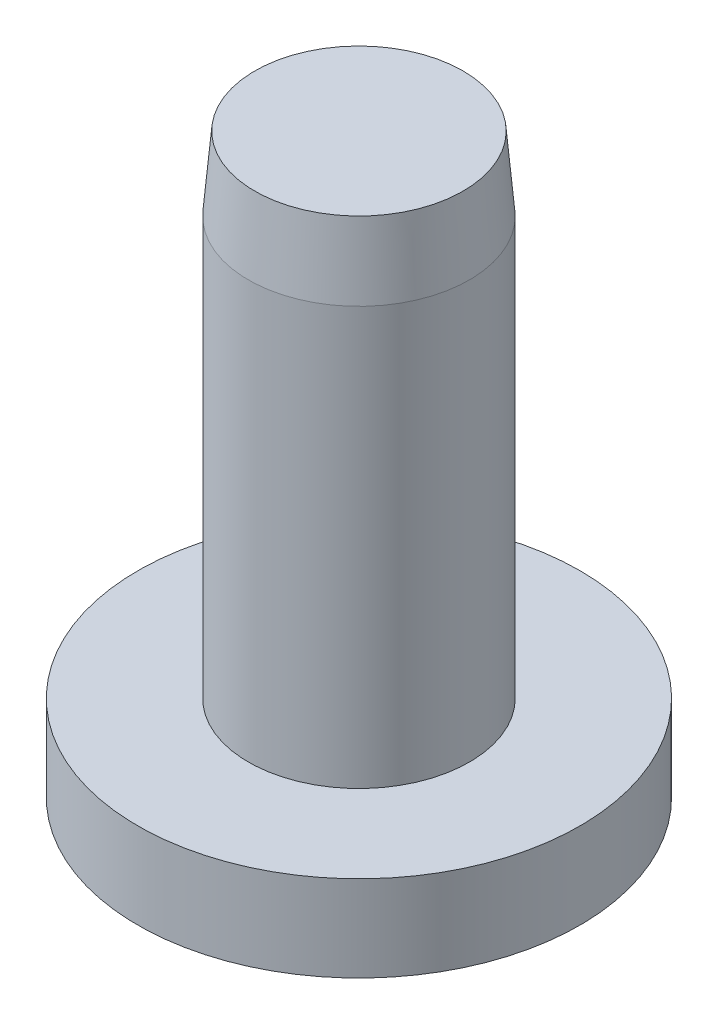
ISO-10303-21;
HEADER;
FILE_DESCRIPTION(('STEP AP214'),'2;1');
FILE_NAME('part.step','',(''),(''),'','','');
FILE_SCHEMA(('AUTOMOTIVE_DESIGN { 1 0 10303 214 1 1 1 1 }'));
ENDSEC;
DATA;
#1=APPLICATION_CONTEXT('core data for automotive mechanical design processes');
#2=APPLICATION_PROTOCOL_DEFINITION('international standard','automotive_design',2000,#1);
#3=PRODUCT_CONTEXT('',#1,'mechanical');
#4=PRODUCT('Part','Part','',(#3));
#5=PRODUCT_RELATED_PRODUCT_CATEGORY('part','',(#4));
#6=PRODUCT_DEFINITION_FORMATION('','',#4);
#7=PRODUCT_DEFINITION_CONTEXT('part definition',#1,'design');
#8=PRODUCT_DEFINITION('design','',#6,#7);
#9=PRODUCT_DEFINITION_SHAPE('','',#8);
#10=(LENGTH_UNIT() NAMED_UNIT(*) SI_UNIT(.MILLI.,.METRE.));
#11=(NAMED_UNIT(*) PLANE_ANGLE_UNIT() SI_UNIT($,.RADIAN.));
#12=(NAMED_UNIT(*) SI_UNIT($,.STERADIAN.) SOLID_ANGLE_UNIT());
#13=UNCERTAINTY_MEASURE_WITH_UNIT(LENGTH_MEASURE(1.E-05),#10,'distance_accuracy_value','');
#14=(GEOMETRIC_REPRESENTATION_CONTEXT(3) GLOBAL_UNCERTAINTY_ASSIGNED_CONTEXT((#13)) GLOBAL_UNIT_ASSIGNED_CONTEXT((#10,
#11,#12)) REPRESENTATION_CONTEXT('',''));
#15=CARTESIAN_POINT('',(0.,0.,0.));
#16=DIRECTION('',(0.,0.,1.));
#17=DIRECTION('',(1.,0.,0.));
#18=AXIS2_PLACEMENT_3D('',#15,#16,#17);
#19=CARTESIAN_POINT('',(-8.,0.,0.));
#20=DIRECTION('',(0.,1.,0.));
#21=DIRECTION('',(0.,0.,1.));
#22=AXIS2_PLACEMENT_3D('',#19,#20,#21);
#23=PLANE('',#22);
#24=CARTESIAN_POINT('',(0.,0.,0.));
#25=DIRECTION('',(0.,-1.,0.));
#26=DIRECTION('',(0.,0.,-1.));
#27=AXIS2_PLACEMENT_3D('',#24,#25,#26);
#28=CIRCLE('',#27,8.);
#29=CARTESIAN_POINT('',(0.,0.,-8.));
#30=VERTEX_POINT('',#29);
#31=EDGE_CURVE('E60',#30,#30,#28,.T.);
#32=ORIENTED_EDGE('',*,*,#31,.T.);
#33=EDGE_LOOP('',(#32));
#34=FACE_BOUND('',#33,.T.);
#35=ADVANCED_FACE('F33',(#34),#23,.F.);
#36=CARTESIAN_POINT('',(0.,21.5,0.));
#37=DIRECTION('',(0.,-1.,0.));
#38=DIRECTION('',(0.,0.,-1.));
#39=AXIS2_PLACEMENT_3D('',#36,#37,#38);
#40=PLANE('',#39);
#41=CARTESIAN_POINT('',(0.,21.5,0.));
#42=DIRECTION('',(0.,-1.,0.));
#43=DIRECTION('',(0.,0.,-1.));
#44=AXIS2_PLACEMENT_3D('',#41,#42,#43);
#45=CIRCLE('',#44,4.24000000000001);
#46=CARTESIAN_POINT('',(0.,21.5,-4.24000000000001));
#47=VERTEX_POINT('',#46);
#48=EDGE_CURVE('E10',#47,#47,#45,.F.);
#49=ORIENTED_EDGE('',*,*,#48,.T.);
#50=EDGE_LOOP('',(#49));
#51=FACE_BOUND('',#50,.T.);
#52=ADVANCED_FACE('F91',(#51),#40,.F.);
#53=CARTESIAN_POINT('',(0.,0.,0.));
#54=DIRECTION('',(0.,-1.,0.));
#55=DIRECTION('',(0.,0.,-1.));
#56=AXIS2_PLACEMENT_3D('',#53,#54,#55);
#57=CYLINDRICAL_SURFACE('',#56,4.5);
#58=CARTESIAN_POINT('',(0.,18.5,0.));
#59=DIRECTION('',(0.,-1.,0.));
#60=DIRECTION('',(0.,0.,-1.));
#61=AXIS2_PLACEMENT_3D('',#58,#59,#60);
#62=CIRCLE('',#61,4.5);
#63=CARTESIAN_POINT('',(0.,18.5,-4.5));
#64=VERTEX_POINT('',#63);
#65=EDGE_CURVE('E41',#64,#64,#62,.T.);
#66=ORIENTED_EDGE('',*,*,#65,.T.);
#67=EDGE_LOOP('',(#66));
#68=FACE_BOUND('',#67,.T.);
#69=CARTESIAN_POINT('',(0.,1.5,0.));
#70=DIRECTION('',(0.,-1.,0.));
#71=DIRECTION('',(0.,0.,-1.));
#72=AXIS2_PLACEMENT_3D('',#69,#70,#71);
#73=CIRCLE('',#72,4.5);
#74=CARTESIAN_POINT('',(0.,1.5,-4.5));
#75=VERTEX_POINT('',#74);
#76=EDGE_CURVE('E45',#75,#75,#73,.T.);
#77=ORIENTED_EDGE('',*,*,#76,.F.);
#78=EDGE_LOOP('',(#77));
#79=FACE_BOUND('',#78,.T.);
#80=ADVANCED_FACE('F86',(#68,#79),#57,.T.);
#81=CARTESIAN_POINT('',(-4.5,1.5,0.));
#82=DIRECTION('',(0.,-1.,0.));
#83=DIRECTION('',(0.,0.,-1.));
#84=AXIS2_PLACEMENT_3D('',#81,#82,#83);
#85=PLANE('',#84);
#86=CARTESIAN_POINT('',(0.,1.5,0.));
#87=DIRECTION('',(0.,-1.,0.));
#88=DIRECTION('',(0.,0.,-1.));
#89=AXIS2_PLACEMENT_3D('',#86,#87,#88);
#90=CIRCLE('',#89,9.);
#91=CARTESIAN_POINT('',(0.,1.5,-9.));
#92=VERTEX_POINT('',#91);
#93=EDGE_CURVE('E49',#92,#92,#90,.T.);
#94=ORIENTED_EDGE('',*,*,#93,.F.);
#95=EDGE_LOOP('',(#94));
#96=FACE_BOUND('',#95,.T.);
#97=ORIENTED_EDGE('',*,*,#76,.T.);
#98=EDGE_LOOP('',(#97));
#99=FACE_BOUND('',#98,.T.);
#100=ADVANCED_FACE('F80',(#96,#99),#85,.F.);
#101=CARTESIAN_POINT('',(0.,0.,0.));
#102=DIRECTION('',(0.,-1.,0.));
#103=DIRECTION('',(0.,0.,-1.));
#104=AXIS2_PLACEMENT_3D('',#101,#102,#103);
#105=CYLINDRICAL_SURFACE('',#104,9.);
#106=CARTESIAN_POINT('',(0.,-2.,0.));
#107=DIRECTION('',(0.,-1.,0.));
#108=DIRECTION('',(0.,0.,-1.));
#109=AXIS2_PLACEMENT_3D('',#106,#107,#108);
#110=CIRCLE('',#109,9.);
#111=CARTESIAN_POINT('',(0.,-2.,-9.));
#112=VERTEX_POINT('',#111);
#113=EDGE_CURVE('E54',#112,#112,#110,.T.);
#114=ORIENTED_EDGE('',*,*,#113,.F.);
#115=EDGE_LOOP('',(#114));
#116=FACE_BOUND('',#115,.T.);
#117=ORIENTED_EDGE('',*,*,#93,.T.);
#118=EDGE_LOOP('',(#117));
#119=FACE_BOUND('',#118,.T.);
#120=ADVANCED_FACE('F74',(#116,#119),#105,.T.);
#121=CARTESIAN_POINT('',(-9.,-2.,0.));
#122=DIRECTION('',(0.,1.,0.));
#123=DIRECTION('',(0.,0.,1.));
#124=AXIS2_PLACEMENT_3D('',#121,#122,#123);
#125=PLANE('',#124);
#126=CARTESIAN_POINT('',(0.,-2.,0.));
#127=DIRECTION('',(0.,-1.,0.));
#128=DIRECTION('',(0.,0.,-1.));
#129=AXIS2_PLACEMENT_3D('',#126,#127,#128);
#130=CIRCLE('',#129,8.);
#131=CARTESIAN_POINT('',(0.,-2.,-8.));
#132=VERTEX_POINT('',#131);
#133=EDGE_CURVE('E57',#132,#132,#130,.T.);
#134=ORIENTED_EDGE('',*,*,#133,.F.);
#135=EDGE_LOOP('',(#134));
#136=FACE_BOUND('',#135,.T.);
#137=ORIENTED_EDGE('',*,*,#113,.T.);
#138=EDGE_LOOP('',(#137));
#139=FACE_BOUND('',#138,.T.);
#140=ADVANCED_FACE('F68',(#136,#139),#125,.F.);
#141=CARTESIAN_POINT('',(0.,0.,0.));
#142=DIRECTION('',(0.,-1.,0.));
#143=DIRECTION('',(0.,0.,-1.));
#144=AXIS2_PLACEMENT_3D('',#141,#142,#143);
#145=CYLINDRICAL_SURFACE('',#144,8.);
#146=ORIENTED_EDGE('',*,*,#31,.F.);
#147=EDGE_LOOP('',(#146));
#148=FACE_BOUND('',#147,.T.);
#149=ORIENTED_EDGE('',*,*,#133,.T.);
#150=EDGE_LOOP('',(#149));
#151=FACE_BOUND('',#150,.T.);
#152=ADVANCED_FACE('F65',(#148,#151),#145,.F.);
#153=CARTESIAN_POINT('',(0.,18.5,0.));
#154=DIRECTION('',(0.,-1.,0.));
#155=DIRECTION('',(0.,0.,-1.));
#156=AXIS2_PLACEMENT_3D('',#153,#154,#155);
#157=CONICAL_SURFACE('',#156,4.5,0.0864506516873704);
#158=ORIENTED_EDGE('',*,*,#48,.F.);
#159=EDGE_LOOP('',(#158));
#160=FACE_BOUND('',#159,.T.);
#161=ORIENTED_EDGE('',*,*,#65,.F.);
#162=EDGE_LOOP('',(#161));
#163=FACE_BOUND('',#162,.T.);
#164=ADVANCED_FACE('F36',(#160,#163),#157,.T.);
#165=CLOSED_SHELL('',(#35,#52,#80,#100,#120,#140,#152,#164));
#166=MANIFOLD_SOLID_BREP('B2',#165);
#167=ADVANCED_BREP_SHAPE_REPRESENTATION('',(#18,#166),#14);
#168=SHAPE_DEFINITION_REPRESENTATION(#9,#167);
ENDSEC;
END-ISO-10303-21;
